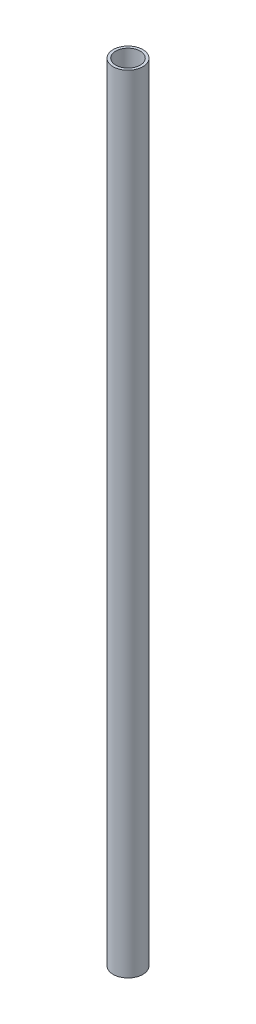
ISO-10303-21;
HEADER;
FILE_DESCRIPTION(('STEP AP214'),'2;1');
FILE_NAME('part.step','',(''),(''),'','','');
FILE_SCHEMA(('AUTOMOTIVE_DESIGN { 1 0 10303 214 1 1 1 1 }'));
ENDSEC;
DATA;
#1=APPLICATION_CONTEXT('core data for automotive mechanical design processes');
#2=APPLICATION_PROTOCOL_DEFINITION('international standard','automotive_design',2000,#1);
#3=PRODUCT_CONTEXT('',#1,'mechanical');
#4=PRODUCT('Part','Part','',(#3));
#5=PRODUCT_RELATED_PRODUCT_CATEGORY('part','',(#4));
#6=PRODUCT_DEFINITION_FORMATION('','',#4);
#7=PRODUCT_DEFINITION_CONTEXT('part definition',#1,'design');
#8=PRODUCT_DEFINITION('design','',#6,#7);
#9=PRODUCT_DEFINITION_SHAPE('','',#8);
#10=(LENGTH_UNIT() NAMED_UNIT(*) SI_UNIT(.MILLI.,.METRE.));
#11=(NAMED_UNIT(*) PLANE_ANGLE_UNIT() SI_UNIT($,.RADIAN.));
#12=(NAMED_UNIT(*) SI_UNIT($,.STERADIAN.) SOLID_ANGLE_UNIT());
#13=UNCERTAINTY_MEASURE_WITH_UNIT(LENGTH_MEASURE(1.E-05),#10,'distance_accuracy_value','');
#14=(GEOMETRIC_REPRESENTATION_CONTEXT(3) GLOBAL_UNCERTAINTY_ASSIGNED_CONTEXT((#13)) GLOBAL_UNIT_ASSIGNED_CONTEXT((#10,
#11,#12)) REPRESENTATION_CONTEXT('',''));
#15=CARTESIAN_POINT('',(0.,0.,0.));
#16=DIRECTION('',(0.,0.,1.));
#17=DIRECTION('',(1.,0.,0.));
#18=AXIS2_PLACEMENT_3D('',#15,#16,#17);
#19=CARTESIAN_POINT('',(0.,900.000000000001,0.));
#20=DIRECTION('',(0.,1.,0.));
#21=DIRECTION('',(0.,0.,1.));
#22=AXIS2_PLACEMENT_3D('',#19,#20,#21);
#23=PLANE('',#22);
#24=CARTESIAN_POINT('',(0.,900.000000000001,0.));
#25=DIRECTION('',(0.,1.,0.));
#26=DIRECTION('',(0.,0.,1.));
#27=AXIS2_PLACEMENT_3D('',#24,#25,#26);
#28=CIRCLE('',#27,17.);
#29=CARTESIAN_POINT('',(0.,900.000000000001,17.));
#30=VERTEX_POINT('',#29);
#31=EDGE_CURVE('E11',#30,#30,#28,.T.);
#32=ORIENTED_EDGE('',*,*,#31,.T.);
#33=EDGE_LOOP('',(#32));
#34=FACE_BOUND('',#33,.T.);
#35=CARTESIAN_POINT('',(0.,900.000000000001,0.));
#36=DIRECTION('',(0.,1.,0.));
#37=DIRECTION('',(1.,0.,0.));
#38=AXIS2_PLACEMENT_3D('',#35,#36,#37);
#39=CIRCLE('',#38,14.);
#40=CARTESIAN_POINT('',(14.,900.000000000001,0.));
#41=VERTEX_POINT('',#40);
#42=EDGE_CURVE('E49',#41,#41,#39,.T.);
#43=ORIENTED_EDGE('',*,*,#42,.F.);
#44=EDGE_LOOP('',(#43));
#45=FACE_BOUND('',#44,.T.);
#46=ADVANCED_FACE('F38',(#34,#45),#23,.T.);
#47=CARTESIAN_POINT('',(0.,0.,0.));
#48=DIRECTION('',(0.,1.,0.));
#49=DIRECTION('',(0.,0.,1.));
#50=AXIS2_PLACEMENT_3D('',#47,#48,#49);
#51=PLANE('',#50);
#52=CARTESIAN_POINT('',(0.,0.,0.));
#53=DIRECTION('',(0.,1.,0.));
#54=DIRECTION('',(0.,0.,1.));
#55=AXIS2_PLACEMENT_3D('',#52,#53,#54);
#56=CIRCLE('',#55,17.);
#57=CARTESIAN_POINT('',(0.,0.,17.));
#58=VERTEX_POINT('',#57);
#59=EDGE_CURVE('E42',#58,#58,#56,.T.);
#60=ORIENTED_EDGE('',*,*,#59,.F.);
#61=EDGE_LOOP('',(#60));
#62=FACE_BOUND('',#61,.T.);
#63=CARTESIAN_POINT('',(0.,0.,0.));
#64=DIRECTION('',(0.,1.,0.));
#65=DIRECTION('',(1.,0.,0.));
#66=AXIS2_PLACEMENT_3D('',#63,#64,#65);
#67=CIRCLE('',#66,14.);
#68=CARTESIAN_POINT('',(14.,0.,0.));
#69=VERTEX_POINT('',#68);
#70=EDGE_CURVE('E51',#69,#69,#67,.T.);
#71=ORIENTED_EDGE('',*,*,#70,.T.);
#72=EDGE_LOOP('',(#71));
#73=FACE_BOUND('',#72,.T.);
#74=ADVANCED_FACE('F61',(#62,#73),#51,.F.);
#75=CARTESIAN_POINT('',(0.,900.000000000001,0.));
#76=DIRECTION('',(0.,-1.,0.));
#77=DIRECTION('',(0.,0.,-1.));
#78=AXIS2_PLACEMENT_3D('',#75,#76,#77);
#79=CYLINDRICAL_SURFACE('',#78,17.);
#80=ORIENTED_EDGE('',*,*,#31,.F.);
#81=EDGE_LOOP('',(#80));
#82=FACE_BOUND('',#81,.T.);
#83=ORIENTED_EDGE('',*,*,#59,.T.);
#84=EDGE_LOOP('',(#83));
#85=FACE_BOUND('',#84,.T.);
#86=ADVANCED_FACE('F40',(#82,#85),#79,.T.);
#87=CARTESIAN_POINT('',(0.,900.000000000001,0.));
#88=DIRECTION('',(0.,-1.,0.));
#89=DIRECTION('',(0.,0.,-1.));
#90=AXIS2_PLACEMENT_3D('',#87,#88,#89);
#91=CYLINDRICAL_SURFACE('',#90,14.);
#92=ORIENTED_EDGE('',*,*,#42,.T.);
#93=EDGE_LOOP('',(#92));
#94=FACE_BOUND('',#93,.T.);
#95=ORIENTED_EDGE('',*,*,#70,.F.);
#96=EDGE_LOOP('',(#95));
#97=FACE_BOUND('',#96,.T.);
#98=ADVANCED_FACE('F57',(#94,#97),#91,.F.);
#99=CLOSED_SHELL('',(#46,#74,#86,#98));
#100=MANIFOLD_SOLID_BREP('B2',#99);
#101=ADVANCED_BREP_SHAPE_REPRESENTATION('',(#18,#100),#14);
#102=SHAPE_DEFINITION_REPRESENTATION(#9,#101);
ENDSEC;
END-ISO-10303-21;
